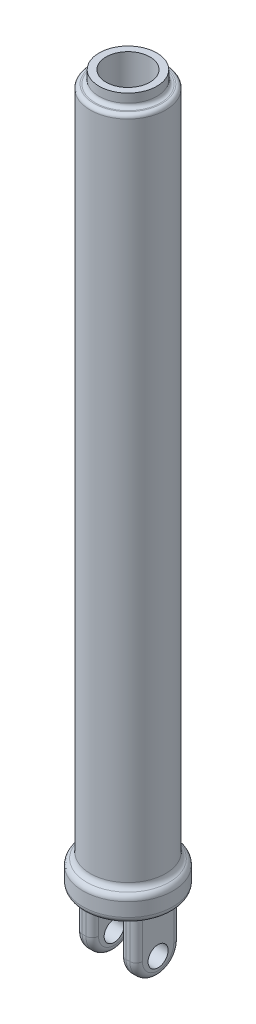
ISO-10303-21;
HEADER;
FILE_DESCRIPTION(('STEP AP214'),'2;1');
FILE_NAME('part.step','',(''),(''),'','','');
FILE_SCHEMA(('AUTOMOTIVE_DESIGN { 1 0 10303 214 1 1 1 1 }'));
ENDSEC;
DATA;
#1=APPLICATION_CONTEXT('core data for automotive mechanical design processes');
#2=APPLICATION_PROTOCOL_DEFINITION('international standard','automotive_design',2000,#1);
#3=PRODUCT_CONTEXT('',#1,'mechanical');
#4=PRODUCT('Part','Part','',(#3));
#5=PRODUCT_RELATED_PRODUCT_CATEGORY('part','',(#4));
#6=PRODUCT_DEFINITION_FORMATION('','',#4);
#7=PRODUCT_DEFINITION_CONTEXT('part definition',#1,'design');
#8=PRODUCT_DEFINITION('design','',#6,#7);
#9=PRODUCT_DEFINITION_SHAPE('','',#8);
#10=(LENGTH_UNIT() NAMED_UNIT(*) SI_UNIT(.MILLI.,.METRE.));
#11=(NAMED_UNIT(*) PLANE_ANGLE_UNIT() SI_UNIT($,.RADIAN.));
#12=(NAMED_UNIT(*) SI_UNIT($,.STERADIAN.) SOLID_ANGLE_UNIT());
#13=UNCERTAINTY_MEASURE_WITH_UNIT(LENGTH_MEASURE(1.E-05),#10,'distance_accuracy_value','');
#14=(GEOMETRIC_REPRESENTATION_CONTEXT(3) GLOBAL_UNCERTAINTY_ASSIGNED_CONTEXT((#13)) GLOBAL_UNIT_ASSIGNED_CONTEXT((#10,
#11,#12)) REPRESENTATION_CONTEXT('',''));
#15=CARTESIAN_POINT('',(0.,0.,0.));
#16=DIRECTION('',(0.,0.,1.));
#17=DIRECTION('',(1.,0.,0.));
#18=AXIS2_PLACEMENT_3D('',#15,#16,#17);
#19=CARTESIAN_POINT('',(23.9999999999998,-50.,17.4999999999999));
#20=DIRECTION('',(-0.999999999999994,0.,0.));
#21=DIRECTION('',(0.,0.,0.999999999999994));
#22=AXIS2_PLACEMENT_3D('',#19,#20,#21);
#23=PLANE('',#22);
#24=DIRECTION('',(0.,0.,0.999999999999994));
#25=VECTOR('',#24,1.);
#26=CARTESIAN_POINT('',(23.9999999999998,0.,17.4999999999999));
#27=LINE('',#26,#25);
#28=CARTESIAN_POINT('',(23.9999999999998,0.,-12.4999999999999));
#29=VERTEX_POINT('',#28);
#30=CARTESIAN_POINT('',(23.9999999999998,0.,12.4999999999999));
#31=VERTEX_POINT('',#30);
#32=EDGE_CURVE('E359',#29,#31,#27,.T.);
#33=ORIENTED_EDGE('',*,*,#32,.T.);
#34=DIRECTION('',(0.,1.,0.));
#35=VECTOR('',#34,1.);
#36=CARTESIAN_POINT('',(23.9999999999998,-50.,12.4999999999999));
#37=LINE('',#36,#35);
#38=CARTESIAN_POINT('',(23.9999999999998,-32.5,12.4999999999999));
#39=VERTEX_POINT('',#38);
#40=EDGE_CURVE('E428',#31,#39,#37,.F.);
#41=ORIENTED_EDGE('',*,*,#40,.T.);
#42=CARTESIAN_POINT('',(23.9999999999998,-32.5,0.));
#43=DIRECTION('',(-0.999999999999994,0.,0.));
#44=DIRECTION('',(0.,0.,0.999999999999994));
#45=AXIS2_PLACEMENT_3D('',#42,#43,#44);
#46=CIRCLE('',#45,12.5);
#47=CARTESIAN_POINT('',(23.9999999999998,-32.5,-12.4999999999999));
#48=VERTEX_POINT('',#47);
#49=EDGE_CURVE('E423',#39,#48,#46,.F.);
#50=ORIENTED_EDGE('',*,*,#49,.T.);
#51=DIRECTION('',(0.,1.,0.));
#52=VECTOR('',#51,1.);
#53=CARTESIAN_POINT('',(23.9999999999998,-50.,-12.4999999999999));
#54=LINE('',#53,#52);
#55=EDGE_CURVE('E425',#48,#29,#54,.T.);
#56=ORIENTED_EDGE('',*,*,#55,.T.);
#57=EDGE_LOOP('',(#33,#41,#50,#56));
#58=FACE_BOUND('',#57,.T.);
#59=CARTESIAN_POINT('',(23.9999999999998,-34.9999999999999,0.));
#60=DIRECTION('',(0.999999999999994,0.,0.));
#61=DIRECTION('',(0.,0.,-0.999999999999994));
#62=AXIS2_PLACEMENT_3D('',#59,#60,#61);
#63=CIRCLE('',#62,8.);
#64=CARTESIAN_POINT('',(23.9999999999998,-34.9999999999999,-7.99999999999997));
#65=VERTEX_POINT('',#64);
#66=EDGE_CURVE('E205',#65,#65,#63,.T.);
#67=ORIENTED_EDGE('',*,*,#66,.F.);
#68=EDGE_LOOP('',(#67));
#69=FACE_BOUND('',#68,.T.);
#70=ADVANCED_FACE('F64',(#58,#69),#23,.F.);
#71=CARTESIAN_POINT('',(10.9999999999999,-50.,17.4999999999999));
#72=DIRECTION('',(0.999999999999994,0.,0.));
#73=DIRECTION('',(0.,0.,-0.999999999999994));
#74=AXIS2_PLACEMENT_3D('',#71,#72,#73);
#75=PLANE('',#74);
#76=CARTESIAN_POINT('',(10.9999999999999,-34.9999999999999,0.));
#77=DIRECTION('',(0.999999999999994,0.,0.));
#78=DIRECTION('',(0.,0.,-0.999999999999994));
#79=AXIS2_PLACEMENT_3D('',#76,#77,#78);
#80=CIRCLE('',#79,8.);
#81=CARTESIAN_POINT('',(10.9999999999999,-34.9999999999999,-7.99999999999998));
#82=VERTEX_POINT('',#81);
#83=EDGE_CURVE('E337',#82,#82,#80,.T.);
#84=ORIENTED_EDGE('',*,*,#83,.T.);
#85=EDGE_LOOP('',(#84));
#86=FACE_BOUND('',#85,.T.);
#87=CARTESIAN_POINT('',(10.9999999999999,-32.5,0.));
#88=DIRECTION('',(0.999999999999994,0.,0.));
#89=DIRECTION('',(0.,0.,-0.999999999999994));
#90=AXIS2_PLACEMENT_3D('',#87,#88,#89);
#91=CIRCLE('',#90,12.5);
#92=CARTESIAN_POINT('',(10.9999999999999,-32.5,-12.4999999999999));
#93=VERTEX_POINT('',#92);
#94=CARTESIAN_POINT('',(10.9999999999999,-32.5,12.4999999999999));
#95=VERTEX_POINT('',#94);
#96=EDGE_CURVE('E437',#93,#95,#91,.F.);
#97=ORIENTED_EDGE('',*,*,#96,.T.);
#98=DIRECTION('',(0.,1.,0.));
#99=VECTOR('',#98,1.);
#100=CARTESIAN_POINT('',(10.9999999999999,-50.,12.4999999999999));
#101=LINE('',#100,#99);
#102=CARTESIAN_POINT('',(11.,0.,12.4999999999999));
#103=VERTEX_POINT('',#102);
#104=EDGE_CURVE('E221',#95,#103,#101,.T.);
#105=ORIENTED_EDGE('',*,*,#104,.T.);
#106=DIRECTION('',(0.,0.,-0.999999999999994));
#107=VECTOR('',#106,1.);
#108=CARTESIAN_POINT('',(10.9999999999999,0.,17.4999999999999));
#109=LINE('',#108,#107);
#110=CARTESIAN_POINT('',(10.9999999999999,0.,-12.4999999999999));
#111=VERTEX_POINT('',#110);
#112=EDGE_CURVE('E365',#103,#111,#109,.T.);
#113=ORIENTED_EDGE('',*,*,#112,.T.);
#114=DIRECTION('',(0.,1.,0.));
#115=VECTOR('',#114,1.);
#116=CARTESIAN_POINT('',(10.9999999999999,-50.,-12.4999999999999));
#117=LINE('',#116,#115);
#118=EDGE_CURVE('E440',#111,#93,#117,.F.);
#119=ORIENTED_EDGE('',*,*,#118,.T.);
#120=EDGE_LOOP('',(#97,#105,#113,#119));
#121=FACE_BOUND('',#120,.T.);
#122=ADVANCED_FACE('F488',(#86,#121),#75,.F.);
#123=CARTESIAN_POINT('',(-11.,-50.,17.4999999999999));
#124=DIRECTION('',(-0.999999999999994,0.,0.));
#125=DIRECTION('',(0.,0.,0.999999999999994));
#126=AXIS2_PLACEMENT_3D('',#123,#124,#125);
#127=PLANE('',#126);
#128=CARTESIAN_POINT('',(-11.,-34.9999999999999,0.));
#129=DIRECTION('',(-0.999999999999994,0.,0.));
#130=DIRECTION('',(0.,0.,0.999999999999994));
#131=AXIS2_PLACEMENT_3D('',#128,#129,#130);
#132=CIRCLE('',#131,8.);
#133=CARTESIAN_POINT('',(-11.,-34.9999999999999,7.99999999999991));
#134=VERTEX_POINT('',#133);
#135=EDGE_CURVE('E334',#134,#134,#132,.T.);
#136=ORIENTED_EDGE('',*,*,#135,.T.);
#137=EDGE_LOOP('',(#136));
#138=FACE_BOUND('',#137,.T.);
#139=CARTESIAN_POINT('',(-11.,-32.5,0.));
#140=DIRECTION('',(-0.999999999999994,0.,0.));
#141=DIRECTION('',(0.,0.,0.999999999999994));
#142=AXIS2_PLACEMENT_3D('',#139,#140,#141);
#143=CIRCLE('',#142,12.5);
#144=CARTESIAN_POINT('',(-11.,-32.5,12.4999999999998));
#145=VERTEX_POINT('',#144);
#146=CARTESIAN_POINT('',(-11.,-32.5,-12.5));
#147=VERTEX_POINT('',#146);
#148=EDGE_CURVE('E445',#145,#147,#143,.F.);
#149=ORIENTED_EDGE('',*,*,#148,.T.);
#150=DIRECTION('',(0.,1.,0.));
#151=VECTOR('',#150,1.);
#152=CARTESIAN_POINT('',(-11.,-50.,-12.4999999999999));
#153=LINE('',#152,#151);
#154=CARTESIAN_POINT('',(-11.,0.,-12.4999999999999));
#155=VERTEX_POINT('',#154);
#156=EDGE_CURVE('E265',#147,#155,#153,.T.);
#157=ORIENTED_EDGE('',*,*,#156,.T.);
#158=DIRECTION('',(0.,0.,0.999999999999994));
#159=VECTOR('',#158,1.);
#160=CARTESIAN_POINT('',(-11.,0.,17.4999999999999));
#161=LINE('',#160,#159);
#162=CARTESIAN_POINT('',(-10.9999999999999,0.,12.4999999999999));
#163=VERTEX_POINT('',#162);
#164=EDGE_CURVE('E346',#155,#163,#161,.T.);
#165=ORIENTED_EDGE('',*,*,#164,.T.);
#166=DIRECTION('',(0.,1.,0.));
#167=VECTOR('',#166,1.);
#168=CARTESIAN_POINT('',(-11.,-50.,12.4999999999999));
#169=LINE('',#168,#167);
#170=EDGE_CURVE('E273',#163,#145,#169,.F.);
#171=ORIENTED_EDGE('',*,*,#170,.T.);
#172=EDGE_LOOP('',(#149,#157,#165,#171));
#173=FACE_BOUND('',#172,.T.);
#174=ADVANCED_FACE('F450',(#138,#173),#127,.F.);
#175=CARTESIAN_POINT('',(-23.9999999999998,-50.,17.4999999999998));
#176=DIRECTION('',(0.999999999999994,0.,0.));
#177=DIRECTION('',(0.,0.,-0.999999999999994));
#178=AXIS2_PLACEMENT_3D('',#175,#176,#177);
#179=PLANE('',#178);
#180=CARTESIAN_POINT('',(-23.9999999999998,-34.9999999999999,0.));
#181=DIRECTION('',(0.999999999999994,0.,0.));
#182=DIRECTION('',(0.,0.,-0.999999999999994));
#183=AXIS2_PLACEMENT_3D('',#180,#181,#182);
#184=CIRCLE('',#183,8.);
#185=CARTESIAN_POINT('',(-23.9999999999998,-34.9999999999999,-7.99999999999999));
#186=VERTEX_POINT('',#185);
#187=EDGE_CURVE('E333',#186,#186,#184,.T.);
#188=ORIENTED_EDGE('',*,*,#187,.T.);
#189=EDGE_LOOP('',(#188));
#190=FACE_BOUND('',#189,.T.);
#191=CARTESIAN_POINT('',(-23.9999999999998,-32.5,0.));
#192=DIRECTION('',(0.999999999999994,0.,0.));
#193=DIRECTION('',(0.,0.,-0.999999999999994));
#194=AXIS2_PLACEMENT_3D('',#191,#192,#193);
#195=CIRCLE('',#194,12.5);
#196=CARTESIAN_POINT('',(-23.9999999999998,-32.5,-12.4999999999999));
#197=VERTEX_POINT('',#196);
#198=CARTESIAN_POINT('',(-23.9999999999998,-32.5,12.4999999999999));
#199=VERTEX_POINT('',#198);
#200=EDGE_CURVE('E82',#197,#199,#195,.F.);
#201=ORIENTED_EDGE('',*,*,#200,.T.);
#202=DIRECTION('',(0.,1.,0.));
#203=VECTOR('',#202,1.);
#204=CARTESIAN_POINT('',(-23.9999999999998,-50.,12.4999999999999));
#205=LINE('',#204,#203);
#206=CARTESIAN_POINT('',(-23.9999999999998,0.,12.4999999999999));
#207=VERTEX_POINT('',#206);
#208=EDGE_CURVE('E217',#199,#207,#205,.T.);
#209=ORIENTED_EDGE('',*,*,#208,.T.);
#210=DIRECTION('',(0.,0.,-0.999999999999994));
#211=VECTOR('',#210,1.);
#212=CARTESIAN_POINT('',(-23.9999999999998,0.,17.4999999999999));
#213=LINE('',#212,#211);
#214=CARTESIAN_POINT('',(-23.9999999999998,0.,-12.4999999999999));
#215=VERTEX_POINT('',#214);
#216=EDGE_CURVE('E354',#207,#215,#213,.T.);
#217=ORIENTED_EDGE('',*,*,#216,.T.);
#218=DIRECTION('',(0.,1.,0.));
#219=VECTOR('',#218,1.);
#220=CARTESIAN_POINT('',(-23.9999999999998,-50.,-12.4999999999999));
#221=LINE('',#220,#219);
#222=EDGE_CURVE('E87',#215,#197,#221,.F.);
#223=ORIENTED_EDGE('',*,*,#222,.T.);
#224=EDGE_LOOP('',(#201,#209,#217,#223));
#225=FACE_BOUND('',#224,.T.);
#226=ADVANCED_FACE('F473',(#190,#225),#179,.F.);
#227=CARTESIAN_POINT('',(10.9999999999999,-50.,-17.4999999999999));
#228=DIRECTION('',(0.,0.,0.999999999999994));
#229=DIRECTION('',(0.999999999999994,0.,0.));
#230=AXIS2_PLACEMENT_3D('',#227,#228,#229);
#231=PLANE('',#230);
#232=DIRECTION('',(0.999999999999994,0.,0.));
#233=VECTOR('',#232,1.);
#234=CARTESIAN_POINT('',(11.,0.,-17.4999999999999));
#235=LINE('',#234,#233);
#236=CARTESIAN_POINT('',(15.9999999999999,0.,-17.4999999999999));
#237=VERTEX_POINT('',#236);
#238=CARTESIAN_POINT('',(18.9999999999999,0.,-17.4999999999999));
#239=VERTEX_POINT('',#238);
#240=EDGE_CURVE('E369',#237,#239,#235,.T.);
#241=ORIENTED_EDGE('',*,*,#240,.T.);
#242=DIRECTION('',(0.,1.,0.));
#243=VECTOR('',#242,1.);
#244=CARTESIAN_POINT('',(18.9999999999999,-50.,-17.4999999999999));
#245=LINE('',#244,#243);
#246=CARTESIAN_POINT('',(18.9999999999999,-32.5,-17.4999999999999));
#247=VERTEX_POINT('',#246);
#248=EDGE_CURVE('E434',#239,#247,#245,.F.);
#249=ORIENTED_EDGE('',*,*,#248,.T.);
#250=DIRECTION('',(0.999999999999994,0.,0.));
#251=VECTOR('',#250,1.);
#252=CARTESIAN_POINT('',(-35.8238545691087,-32.5,-17.4999999999999));
#253=LINE('',#252,#251);
#254=CARTESIAN_POINT('',(15.9999999999999,-32.5,-17.4999999999999));
#255=VERTEX_POINT('',#254);
#256=EDGE_CURVE('E341',#255,#247,#253,.T.);
#257=ORIENTED_EDGE('',*,*,#256,.F.);
#258=DIRECTION('',(0.,1.,0.));
#259=VECTOR('',#258,1.);
#260=CARTESIAN_POINT('',(15.9999999999999,-50.,-17.4999999999999));
#261=LINE('',#260,#259);
#262=EDGE_CURVE('E431',#255,#237,#261,.T.);
#263=ORIENTED_EDGE('',*,*,#262,.T.);
#264=EDGE_LOOP('',(#241,#249,#257,#263));
#265=FACE_BOUND('',#264,.T.);
#266=ADVANCED_FACE('F720',(#265),#231,.F.);
#267=CARTESIAN_POINT('',(-11.,-50.,-17.4999999999999));
#268=DIRECTION('',(0.,0.,0.999999999999994));
#269=DIRECTION('',(0.999999999999994,0.,0.));
#270=AXIS2_PLACEMENT_3D('',#267,#268,#269);
#271=PLANE('',#270);
#272=DIRECTION('',(0.999999999999994,0.,0.));
#273=VECTOR('',#272,1.);
#274=CARTESIAN_POINT('',(-11.,0.,-17.4999999999999));
#275=LINE('',#274,#273);
#276=CARTESIAN_POINT('',(-18.9999999999999,0.,-17.4999999999999));
#277=VERTEX_POINT('',#276);
#278=CARTESIAN_POINT('',(-15.9999999999999,0.,-17.4999999999999));
#279=VERTEX_POINT('',#278);
#280=EDGE_CURVE('E356',#277,#279,#275,.T.);
#281=ORIENTED_EDGE('',*,*,#280,.T.);
#282=DIRECTION('',(0.,1.,0.));
#283=VECTOR('',#282,1.);
#284=CARTESIAN_POINT('',(-15.9999999999999,-50.,-17.4999999999999));
#285=LINE('',#284,#283);
#286=CARTESIAN_POINT('',(-15.9999999999999,-32.5,-17.4999999999999));
#287=VERTEX_POINT('',#286);
#288=EDGE_CURVE('E264',#279,#287,#285,.F.);
#289=ORIENTED_EDGE('',*,*,#288,.T.);
#290=CARTESIAN_POINT('',(-18.9999999999999,-32.5,-17.4999999999999));
#291=VERTEX_POINT('',#290);
#292=EDGE_CURVE('E342',#291,#287,#253,.T.);
#293=ORIENTED_EDGE('',*,*,#292,.F.);
#294=DIRECTION('',(0.,1.,0.));
#295=VECTOR('',#294,1.);
#296=CARTESIAN_POINT('',(-18.9999999999999,-50.,-17.4999999999999));
#297=LINE('',#296,#295);
#298=EDGE_CURVE('E258',#291,#277,#297,.T.);
#299=ORIENTED_EDGE('',*,*,#298,.T.);
#300=EDGE_LOOP('',(#281,#289,#293,#299));
#301=FACE_BOUND('',#300,.T.);
#302=ADVANCED_FACE('F474',(#301),#271,.F.);
#303=CARTESIAN_POINT('',(0.,0.,0.));
#304=DIRECTION('',(0.,-1.,0.));
#305=DIRECTION('',(0.,0.,-0.999999999999994));
#306=AXIS2_PLACEMENT_3D('',#303,#304,#305);
#307=PLANE('',#306);
#308=CARTESIAN_POINT('',(0.,0.,0.));
#309=DIRECTION('',(0.,1.,0.));
#310=DIRECTION('',(0.,0.,0.999999999999994));
#311=AXIS2_PLACEMENT_3D('',#308,#309,#310);
#312=CIRCLE('',#311,30.8238545691088);
#313=CARTESIAN_POINT('',(0.,0.,30.8238545691086));
#314=VERTEX_POINT('',#313);
#315=EDGE_CURVE('E193',#314,#314,#312,.T.);
#316=ORIENTED_EDGE('',*,*,#315,.F.);
#317=EDGE_LOOP('',(#316));
#318=FACE_BOUND('',#317,.T.);
#319=DIRECTION('',(-0.999999999999994,0.,0.));
#320=VECTOR('',#319,1.);
#321=CARTESIAN_POINT('',(10.9999999999999,0.,17.4999999999999));
#322=LINE('',#321,#320);
#323=CARTESIAN_POINT('',(18.9999999999999,0.,17.4999999999999));
#324=VERTEX_POINT('',#323);
#325=CARTESIAN_POINT('',(15.9999999999999,0.,17.4999999999999));
#326=VERTEX_POINT('',#325);
#327=EDGE_CURVE('E188',#324,#326,#322,.T.);
#328=ORIENTED_EDGE('',*,*,#327,.F.);
#329=CARTESIAN_POINT('',(18.9999999999999,0.,12.4999999999999));
#330=DIRECTION('',(0.,-1.,0.));
#331=DIRECTION('',(0.,0.,-0.999999999999994));
#332=AXIS2_PLACEMENT_3D('',#329,#330,#331);
#333=CIRCLE('',#332,5.);
#334=EDGE_CURVE('E294',#324,#31,#333,.F.);
#335=ORIENTED_EDGE('',*,*,#334,.T.);
#336=ORIENTED_EDGE('',*,*,#32,.F.);
#337=CARTESIAN_POINT('',(18.9999999999999,0.,-12.4999999999999));
#338=DIRECTION('',(0.,-1.,0.));
#339=DIRECTION('',(0.,0.,-0.999999999999994));
#340=AXIS2_PLACEMENT_3D('',#337,#338,#339);
#341=CIRCLE('',#340,5.);
#342=EDGE_CURVE('E297',#29,#239,#341,.F.);
#343=ORIENTED_EDGE('',*,*,#342,.T.);
#344=ORIENTED_EDGE('',*,*,#240,.F.);
#345=CARTESIAN_POINT('',(15.9999999999999,0.,-12.4999999999999));
#346=DIRECTION('',(0.,-1.,0.));
#347=DIRECTION('',(0.,0.,-0.999999999999994));
#348=AXIS2_PLACEMENT_3D('',#345,#346,#347);
#349=CIRCLE('',#348,5.);
#350=EDGE_CURVE('E302',#237,#111,#349,.F.);
#351=ORIENTED_EDGE('',*,*,#350,.T.);
#352=ORIENTED_EDGE('',*,*,#112,.F.);
#353=CARTESIAN_POINT('',(15.9999999999999,0.,12.4999999999999));
#354=DIRECTION('',(0.,-1.,0.));
#355=DIRECTION('',(0.,0.,-0.999999999999994));
#356=AXIS2_PLACEMENT_3D('',#353,#354,#355);
#357=CIRCLE('',#356,5.);
#358=EDGE_CURVE('E299',#103,#326,#357,.F.);
#359=ORIENTED_EDGE('',*,*,#358,.T.);
#360=EDGE_LOOP('',(#328,#335,#336,#343,#344,#351,#352,#359));
#361=FACE_BOUND('',#360,.T.);
#362=DIRECTION('',(-0.999999999999994,0.,0.));
#363=VECTOR('',#362,1.);
#364=CARTESIAN_POINT('',(-11.,0.,17.4999999999999));
#365=LINE('',#364,#363);
#366=CARTESIAN_POINT('',(-15.9999999999999,0.,17.4999999999999));
#367=VERTEX_POINT('',#366);
#368=CARTESIAN_POINT('',(-18.9999999999999,0.,17.4999999999999));
#369=VERTEX_POINT('',#368);
#370=EDGE_CURVE('E350',#367,#369,#365,.T.);
#371=ORIENTED_EDGE('',*,*,#370,.F.);
#372=CARTESIAN_POINT('',(-15.9999999999999,0.,12.4999999999999));
#373=DIRECTION('',(0.,-1.,0.));
#374=DIRECTION('',(0.,0.,-0.999999999999994));
#375=AXIS2_PLACEMENT_3D('',#372,#373,#374);
#376=CIRCLE('',#375,5.);
#377=EDGE_CURVE('E308',#367,#163,#376,.F.);
#378=ORIENTED_EDGE('',*,*,#377,.T.);
#379=ORIENTED_EDGE('',*,*,#164,.F.);
#380=CARTESIAN_POINT('',(-15.9999999999999,0.,-12.4999999999999));
#381=DIRECTION('',(0.,-1.,0.));
#382=DIRECTION('',(0.,0.,-0.999999999999994));
#383=AXIS2_PLACEMENT_3D('',#380,#381,#382);
#384=CIRCLE('',#383,5.);
#385=EDGE_CURVE('E305',#155,#279,#384,.F.);
#386=ORIENTED_EDGE('',*,*,#385,.T.);
#387=ORIENTED_EDGE('',*,*,#280,.F.);
#388=CARTESIAN_POINT('',(-18.9999999999999,0.,-12.4999999999999));
#389=DIRECTION('',(0.,-1.,0.));
#390=DIRECTION('',(0.,0.,-0.999999999999994));
#391=AXIS2_PLACEMENT_3D('',#388,#389,#390);
#392=CIRCLE('',#391,5.);
#393=EDGE_CURVE('E12',#277,#215,#392,.F.);
#394=ORIENTED_EDGE('',*,*,#393,.T.);
#395=ORIENTED_EDGE('',*,*,#216,.F.);
#396=CARTESIAN_POINT('',(-18.9999999999999,0.,12.4999999999999));
#397=DIRECTION('',(0.,-1.,0.));
#398=DIRECTION('',(0.,0.,-0.999999999999994));
#399=AXIS2_PLACEMENT_3D('',#396,#397,#398);
#400=CIRCLE('',#399,5.);
#401=EDGE_CURVE('E74',#207,#369,#400,.F.);
#402=ORIENTED_EDGE('',*,*,#401,.T.);
#403=EDGE_LOOP('',(#371,#378,#379,#386,#387,#394,#395,#402));
#404=FACE_BOUND('',#403,.T.);
#405=ADVANCED_FACE('F467',(#318,#361,#404),#307,.T.);
#406=CARTESIAN_POINT('',(0.,4.99999999999989,0.));
#407=DIRECTION('',(0.,1.,0.));
#408=DIRECTION('',(0.,0.,0.999999999999994));
#409=AXIS2_PLACEMENT_3D('',#406,#407,#408);
#410=TOROIDAL_SURFACE('',#409,30.8238545691088,5.);
#411=ORIENTED_EDGE('',*,*,#315,.T.);
#412=EDGE_LOOP('',(#411));
#413=FACE_BOUND('',#412,.T.);
#414=CARTESIAN_POINT('',(0.,4.99999999999989,0.));
#415=DIRECTION('',(0.,1.,0.));
#416=DIRECTION('',(0.,0.,0.999999999999994));
#417=AXIS2_PLACEMENT_3D('',#414,#415,#416);
#418=CIRCLE('',#417,35.8238545691088);
#419=CARTESIAN_POINT('',(0.,4.99999999999989,35.8238545691086));
#420=VERTEX_POINT('',#419);
#421=EDGE_CURVE('E412',#420,#420,#418,.T.);
#422=ORIENTED_EDGE('',*,*,#421,.F.);
#423=EDGE_LOOP('',(#422));
#424=FACE_BOUND('',#423,.T.);
#425=ADVANCED_FACE('F542',(#413,#424),#410,.T.);
#426=CARTESIAN_POINT('',(0.,40.,0.));
#427=DIRECTION('',(0.,1.,0.));
#428=DIRECTION('',(0.,0.,0.999999999999994));
#429=AXIS2_PLACEMENT_3D('',#426,#427,#428);
#430=CYLINDRICAL_SURFACE('',#429,35.8238545691088);
#431=ORIENTED_EDGE('',*,*,#421,.T.);
#432=EDGE_LOOP('',(#431));
#433=FACE_BOUND('',#432,.T.);
#434=CARTESIAN_POINT('',(0.,15.891115505243,0.));
#435=DIRECTION('',(0.,1.,0.));
#436=DIRECTION('',(0.,0.,0.999999999999994));
#437=AXIS2_PLACEMENT_3D('',#434,#435,#436);
#438=CIRCLE('',#437,35.8238545691088);
#439=CARTESIAN_POINT('',(0.,15.891115505243,35.8238545691086));
#440=VERTEX_POINT('',#439);
#441=EDGE_CURVE('E408',#440,#440,#438,.T.);
#442=ORIENTED_EDGE('',*,*,#441,.F.);
#443=EDGE_LOOP('',(#442));
#444=FACE_BOUND('',#443,.T.);
#445=ADVANCED_FACE('F538',(#433,#444),#430,.T.);
#446=CARTESIAN_POINT('',(0.,15.891115505243,0.));
#447=DIRECTION('',(0.,1.,0.));
#448=DIRECTION('',(0.,0.,0.999999999999994));
#449=AXIS2_PLACEMENT_3D('',#446,#447,#448);
#450=TOROIDAL_SURFACE('',#449,30.8238545691088,5.);
#451=ORIENTED_EDGE('',*,*,#441,.T.);
#452=EDGE_LOOP('',(#451));
#453=FACE_BOUND('',#452,.T.);
#454=CARTESIAN_POINT('',(0.,20.4342369360451,0.));
#455=DIRECTION('',(0.,1.,0.));
#456=DIRECTION('',(0.,0.,0.999999999999994));
#457=AXIS2_PLACEMENT_3D('',#454,#455,#456);
#458=CIRCLE('',#457,32.9119272845545);
#459=CARTESIAN_POINT('',(0.,20.4342369360451,32.9119272845543));
#460=VERTEX_POINT('',#459);
#461=EDGE_CURVE('E404',#460,#460,#458,.T.);
#462=ORIENTED_EDGE('',*,*,#461,.F.);
#463=EDGE_LOOP('',(#462));
#464=FACE_BOUND('',#463,.T.);
#465=ADVANCED_FACE('F534',(#453,#464),#450,.T.);
#466=CARTESIAN_POINT('',(0.,24.9773583668469,0.));
#467=DIRECTION('',(0.,1.,0.));
#468=DIRECTION('',(0.,0.,0.999999999999994));
#469=AXIS2_PLACEMENT_3D('',#466,#467,#468);
#470=TOROIDAL_SURFACE('',#469,35.0000000000001,4.99999999999999);
#471=ORIENTED_EDGE('',*,*,#461,.T.);
#472=EDGE_LOOP('',(#471));
#473=FACE_BOUND('',#472,.T.);
#474=CARTESIAN_POINT('',(0.,24.9773583668469,0.));
#475=DIRECTION('',(0.,1.,0.));
#476=DIRECTION('',(0.,0.,0.999999999999994));
#477=AXIS2_PLACEMENT_3D('',#474,#475,#476);
#478=CIRCLE('',#477,30.0000000000001);
#479=CARTESIAN_POINT('',(0.,24.9773583668469,29.9999999999999));
#480=VERTEX_POINT('',#479);
#481=EDGE_CURVE('E400',#480,#480,#478,.T.);
#482=ORIENTED_EDGE('',*,*,#481,.F.);
#483=EDGE_LOOP('',(#482));
#484=FACE_BOUND('',#483,.T.);
#485=ADVANCED_FACE('F530',(#473,#484),#470,.F.);
#486=CARTESIAN_POINT('',(0.,40.,0.));
#487=DIRECTION('',(0.,1.,0.));
#488=DIRECTION('',(0.,0.,0.999999999999994));
#489=AXIS2_PLACEMENT_3D('',#486,#487,#488);
#490=CYLINDRICAL_SURFACE('',#489,30.);
#491=ORIENTED_EDGE('',*,*,#481,.T.);
#492=EDGE_LOOP('',(#491));
#493=FACE_BOUND('',#492,.T.);
#494=CARTESIAN_POINT('',(0.,552.,0.));
#495=DIRECTION('',(0.,1.,0.));
#496=DIRECTION('',(0.,0.,0.999999999999994));
#497=AXIS2_PLACEMENT_3D('',#494,#495,#496);
#498=CIRCLE('',#497,30.);
#499=CARTESIAN_POINT('',(0.,552.,29.9999999999998));
#500=VERTEX_POINT('',#499);
#501=EDGE_CURVE('E396',#500,#500,#498,.T.);
#502=ORIENTED_EDGE('',*,*,#501,.F.);
#503=EDGE_LOOP('',(#502));
#504=FACE_BOUND('',#503,.T.);
#505=ADVANCED_FACE('F526',(#493,#504),#490,.T.);
#506=CARTESIAN_POINT('',(0.,552.,0.));
#507=DIRECTION('',(0.,1.,0.));
#508=DIRECTION('',(0.,0.,0.999999999999994));
#509=AXIS2_PLACEMENT_3D('',#506,#507,#508);
#510=TOROIDAL_SURFACE('',#509,27.,3.);
#511=ORIENTED_EDGE('',*,*,#501,.T.);
#512=EDGE_LOOP('',(#511));
#513=FACE_BOUND('',#512,.T.);
#514=CARTESIAN_POINT('',(0.,555.,0.));
#515=DIRECTION('',(0.,1.,0.));
#516=DIRECTION('',(0.,0.,0.999999999999994));
#517=AXIS2_PLACEMENT_3D('',#514,#515,#516);
#518=CIRCLE('',#517,27.);
#519=CARTESIAN_POINT('',(0.,555.,26.9999999999998));
#520=VERTEX_POINT('',#519);
#521=EDGE_CURVE('E392',#520,#520,#518,.T.);
#522=ORIENTED_EDGE('',*,*,#521,.F.);
#523=EDGE_LOOP('',(#522));
#524=FACE_BOUND('',#523,.T.);
#525=ADVANCED_FACE('F522',(#513,#524),#510,.T.);
#526=CARTESIAN_POINT('',(-26.9999999999998,555.,0.));
#527=DIRECTION('',(0.,1.,0.));
#528=DIRECTION('',(0.,0.,0.999999999999994));
#529=AXIS2_PLACEMENT_3D('',#526,#527,#528);
#530=PLANE('',#529);
#531=ORIENTED_EDGE('',*,*,#521,.T.);
#532=EDGE_LOOP('',(#531));
#533=FACE_BOUND('',#532,.T.);
#534=CARTESIAN_POINT('',(0.,555.,0.));
#535=DIRECTION('',(0.,1.,0.));
#536=DIRECTION('',(0.,0.,0.999999999999994));
#537=AXIS2_PLACEMENT_3D('',#534,#535,#536);
#538=CIRCLE('',#537,26.);
#539=CARTESIAN_POINT('',(0.,555.,25.9999999999998));
#540=VERTEX_POINT('',#539);
#541=EDGE_CURVE('E388',#540,#540,#538,.T.);
#542=ORIENTED_EDGE('',*,*,#541,.F.);
#543=EDGE_LOOP('',(#542));
#544=FACE_BOUND('',#543,.T.);
#545=ADVANCED_FACE('F518',(#533,#544),#530,.T.);
#546=CARTESIAN_POINT('',(0.,558.,0.));
#547=DIRECTION('',(0.,1.,0.));
#548=DIRECTION('',(0.,0.,0.999999999999994));
#549=AXIS2_PLACEMENT_3D('',#546,#547,#548);
#550=TOROIDAL_SURFACE('',#549,26.,3.00000000000011);
#551=ORIENTED_EDGE('',*,*,#541,.T.);
#552=EDGE_LOOP('',(#551));
#553=FACE_BOUND('',#552,.T.);
#554=CARTESIAN_POINT('',(0.,558.,0.));
#555=DIRECTION('',(0.,1.,0.));
#556=DIRECTION('',(0.,0.,0.999999999999994));
#557=AXIS2_PLACEMENT_3D('',#554,#555,#556);
#558=CIRCLE('',#557,22.9999999999999);
#559=CARTESIAN_POINT('',(0.,558.,22.9999999999997));
#560=VERTEX_POINT('',#559);
#561=EDGE_CURVE('E384',#560,#560,#558,.T.);
#562=ORIENTED_EDGE('',*,*,#561,.F.);
#563=EDGE_LOOP('',(#562));
#564=FACE_BOUND('',#563,.T.);
#565=ADVANCED_FACE('F514',(#553,#564),#550,.F.);
#566=CARTESIAN_POINT('',(0.,40.,0.));
#567=DIRECTION('',(0.,1.,0.));
#568=DIRECTION('',(0.,0.,0.999999999999994));
#569=AXIS2_PLACEMENT_3D('',#566,#567,#568);
#570=CYLINDRICAL_SURFACE('',#569,22.9999999999999);
#571=ORIENTED_EDGE('',*,*,#561,.T.);
#572=EDGE_LOOP('',(#571));
#573=FACE_BOUND('',#572,.T.);
#574=CARTESIAN_POINT('',(0.,565.,0.));
#575=DIRECTION('',(0.,1.,0.));
#576=DIRECTION('',(0.,0.,0.999999999999994));
#577=AXIS2_PLACEMENT_3D('',#574,#575,#576);
#578=CIRCLE('',#577,23.);
#579=CARTESIAN_POINT('',(0.,565.,22.9999999999999));
#580=VERTEX_POINT('',#579);
#581=EDGE_CURVE('E380',#580,#580,#578,.T.);
#582=ORIENTED_EDGE('',*,*,#581,.F.);
#583=EDGE_LOOP('',(#582));
#584=FACE_BOUND('',#583,.T.);
#585=ADVANCED_FACE('F510',(#573,#584),#570,.T.);
#586=CARTESIAN_POINT('',(-17.4999999999999,565.,0.));
#587=DIRECTION('',(0.,1.,0.));
#588=DIRECTION('',(0.,0.,0.999999999999994));
#589=AXIS2_PLACEMENT_3D('',#586,#587,#588);
#590=PLANE('',#589);
#591=ORIENTED_EDGE('',*,*,#581,.T.);
#592=EDGE_LOOP('',(#591));
#593=FACE_BOUND('',#592,.T.);
#594=CARTESIAN_POINT('',(0.,565.,0.));
#595=DIRECTION('',(0.,1.,0.));
#596=DIRECTION('',(0.,0.,0.999999999999994));
#597=AXIS2_PLACEMENT_3D('',#594,#595,#596);
#598=CIRCLE('',#597,17.5);
#599=CARTESIAN_POINT('',(0.,565.,17.4999999999999));
#600=VERTEX_POINT('',#599);
#601=EDGE_CURVE('E376',#600,#600,#598,.T.);
#602=ORIENTED_EDGE('',*,*,#601,.F.);
#603=EDGE_LOOP('',(#602));
#604=FACE_BOUND('',#603,.T.);
#605=ADVANCED_FACE('F506',(#593,#604),#590,.T.);
#606=CARTESIAN_POINT('',(0.,40.,0.));
#607=DIRECTION('',(0.,1.,0.));
#608=DIRECTION('',(0.,0.,0.999999999999994));
#609=AXIS2_PLACEMENT_3D('',#606,#607,#608);
#610=CYLINDRICAL_SURFACE('',#609,17.5);
#611=ORIENTED_EDGE('',*,*,#601,.T.);
#612=EDGE_LOOP('',(#611));
#613=FACE_BOUND('',#612,.T.);
#614=CARTESIAN_POINT('',(0.,40.,0.));
#615=DIRECTION('',(0.,1.,0.));
#616=DIRECTION('',(0.,0.,0.999999999999994));
#617=AXIS2_PLACEMENT_3D('',#614,#615,#616);
#618=CIRCLE('',#617,17.4999999999999);
#619=CARTESIAN_POINT('',(0.,40.,17.4999999999998));
#620=VERTEX_POINT('',#619);
#621=EDGE_CURVE('E372',#620,#620,#618,.T.);
#622=ORIENTED_EDGE('',*,*,#621,.F.);
#623=EDGE_LOOP('',(#622));
#624=FACE_BOUND('',#623,.T.);
#625=ADVANCED_FACE('F502',(#613,#624),#610,.F.);
#626=CARTESIAN_POINT('',(-17.4999999999998,40.,0.));
#627=DIRECTION('',(0.,1.,0.));
#628=DIRECTION('',(0.,0.,0.999999999999994));
#629=AXIS2_PLACEMENT_3D('',#626,#627,#628);
#630=PLANE('',#629);
#631=ORIENTED_EDGE('',*,*,#621,.T.);
#632=EDGE_LOOP('',(#631));
#633=FACE_BOUND('',#632,.T.);
#634=ADVANCED_FACE('F499',(#633),#630,.T.);
#635=CARTESIAN_POINT('',(10.9999999999999,-50.,17.4999999999999));
#636=DIRECTION('',(0.,0.,-0.999999999999994));
#637=DIRECTION('',(-0.999999999999994,0.,0.));
#638=AXIS2_PLACEMENT_3D('',#635,#636,#637);
#639=PLANE('',#638);
#640=DIRECTION('',(0.999999999999994,0.,0.));
#641=VECTOR('',#640,1.);
#642=CARTESIAN_POINT('',(-35.8238545691087,-32.5,17.4999999999999));
#643=LINE('',#642,#641);
#644=CARTESIAN_POINT('',(15.9999999999999,-32.5,17.4999999999999));
#645=VERTEX_POINT('',#644);
#646=CARTESIAN_POINT('',(18.9999999999999,-32.5,17.4999999999999));
#647=VERTEX_POINT('',#646);
#648=EDGE_CURVE('E185',#645,#647,#643,.T.);
#649=ORIENTED_EDGE('',*,*,#648,.T.);
#650=DIRECTION('',(0.,1.,0.));
#651=VECTOR('',#650,1.);
#652=CARTESIAN_POINT('',(18.9999999999999,-50.,17.4999999999999));
#653=LINE('',#652,#651);
#654=EDGE_CURVE('E192',#647,#324,#653,.T.);
#655=ORIENTED_EDGE('',*,*,#654,.T.);
#656=ORIENTED_EDGE('',*,*,#327,.T.);
#657=DIRECTION('',(0.,1.,0.));
#658=VECTOR('',#657,1.);
#659=CARTESIAN_POINT('',(15.9999999999999,-50.,17.4999999999999));
#660=LINE('',#659,#658);
#661=EDGE_CURVE('E181',#326,#645,#660,.F.);
#662=ORIENTED_EDGE('',*,*,#661,.T.);
#663=EDGE_LOOP('',(#649,#655,#656,#662));
#664=FACE_BOUND('',#663,.T.);
#665=ADVANCED_FACE('F183',(#664),#639,.F.);
#666=CARTESIAN_POINT('',(-11.,-50.,17.4999999999999));
#667=DIRECTION('',(0.,0.,-0.999999999999994));
#668=DIRECTION('',(-0.999999999999994,0.,0.));
#669=AXIS2_PLACEMENT_3D('',#666,#667,#668);
#670=PLANE('',#669);
#671=CARTESIAN_POINT('',(-18.9999999999999,-32.5,17.4999999999999));
#672=VERTEX_POINT('',#671);
#673=CARTESIAN_POINT('',(-15.9999999999999,-32.5,17.4999999999999));
#674=VERTEX_POINT('',#673);
#675=EDGE_CURVE('E204',#672,#674,#643,.T.);
#676=ORIENTED_EDGE('',*,*,#675,.T.);
#677=DIRECTION('',(0.,1.,0.));
#678=VECTOR('',#677,1.);
#679=CARTESIAN_POINT('',(-15.9999999999999,-50.,17.4999999999999));
#680=LINE('',#679,#678);
#681=EDGE_CURVE('E279',#674,#367,#680,.T.);
#682=ORIENTED_EDGE('',*,*,#681,.T.);
#683=ORIENTED_EDGE('',*,*,#370,.T.);
#684=DIRECTION('',(0.,1.,0.));
#685=VECTOR('',#684,1.);
#686=CARTESIAN_POINT('',(-18.9999999999999,-50.,17.4999999999999));
#687=LINE('',#686,#685);
#688=EDGE_CURVE('E269',#369,#672,#687,.F.);
#689=ORIENTED_EDGE('',*,*,#688,.T.);
#690=EDGE_LOOP('',(#676,#682,#683,#689));
#691=FACE_BOUND('',#690,.T.);
#692=ADVANCED_FACE('F470',(#691),#670,.F.);
#693=CARTESIAN_POINT('',(-35.8238545691087,-32.5,0.));
#694=DIRECTION('',(0.999999999999994,0.,0.));
#695=DIRECTION('',(0.,0.,-0.999999999999994));
#696=AXIS2_PLACEMENT_3D('',#693,#694,#695);
#697=CYLINDRICAL_SURFACE('',#696,17.5);
#698=ORIENTED_EDGE('',*,*,#292,.T.);
#699=CARTESIAN_POINT('',(-15.9999999999999,-32.5,0.));
#700=DIRECTION('',(-0.999999999999994,0.,0.));
#701=DIRECTION('',(0.,0.,0.999999999999994));
#702=AXIS2_PLACEMENT_3D('',#699,#700,#701);
#703=CIRCLE('',#702,17.5);
#704=EDGE_CURVE('E291',#287,#674,#703,.T.);
#705=ORIENTED_EDGE('',*,*,#704,.T.);
#706=ORIENTED_EDGE('',*,*,#675,.F.);
#707=CARTESIAN_POINT('',(-18.9999999999999,-32.5,0.));
#708=DIRECTION('',(0.999999999999994,0.,0.));
#709=DIRECTION('',(0.,0.,-0.999999999999994));
#710=AXIS2_PLACEMENT_3D('',#707,#708,#709);
#711=CIRCLE('',#710,17.5);
#712=EDGE_CURVE('E254',#672,#291,#711,.T.);
#713=ORIENTED_EDGE('',*,*,#712,.T.);
#714=EDGE_LOOP('',(#698,#705,#706,#713));
#715=FACE_BOUND('',#714,.T.);
#716=ADVANCED_FACE('F476',(#715),#697,.T.);
#717=ORIENTED_EDGE('',*,*,#256,.T.);
#718=CARTESIAN_POINT('',(18.9999999999999,-32.5,0.));
#719=DIRECTION('',(-0.999999999999994,0.,0.));
#720=DIRECTION('',(0.,0.,0.999999999999994));
#721=AXIS2_PLACEMENT_3D('',#718,#719,#720);
#722=CIRCLE('',#721,17.5);
#723=EDGE_CURVE('E202',#247,#647,#722,.T.);
#724=ORIENTED_EDGE('',*,*,#723,.T.);
#725=ORIENTED_EDGE('',*,*,#648,.F.);
#726=CARTESIAN_POINT('',(15.9999999999999,-32.5,0.));
#727=DIRECTION('',(0.999999999999994,0.,0.));
#728=DIRECTION('',(0.,0.,-0.999999999999994));
#729=AXIS2_PLACEMENT_3D('',#726,#727,#728);
#730=CIRCLE('',#729,17.5);
#731=EDGE_CURVE('E199',#645,#255,#730,.T.);
#732=ORIENTED_EDGE('',*,*,#731,.T.);
#733=EDGE_LOOP('',(#717,#724,#725,#732));
#734=FACE_BOUND('',#733,.T.);
#735=ADVANCED_FACE('F198',(#734),#697,.T.);
#736=CARTESIAN_POINT('',(-35.8238545691087,-34.9999999999999,0.));
#737=DIRECTION('',(0.999999999999994,0.,0.));
#738=DIRECTION('',(0.,0.,-0.999999999999994));
#739=AXIS2_PLACEMENT_3D('',#736,#737,#738);
#740=CYLINDRICAL_SURFACE('',#739,8.);
#741=ORIENTED_EDGE('',*,*,#187,.F.);
#742=EDGE_LOOP('',(#741));
#743=FACE_BOUND('',#742,.T.);
#744=ORIENTED_EDGE('',*,*,#135,.F.);
#745=EDGE_LOOP('',(#744));
#746=FACE_BOUND('',#745,.T.);
#747=ADVANCED_FACE('F483',(#743,#746),#740,.F.);
#748=ORIENTED_EDGE('',*,*,#66,.T.);
#749=EDGE_LOOP('',(#748));
#750=FACE_BOUND('',#749,.T.);
#751=ORIENTED_EDGE('',*,*,#83,.F.);
#752=EDGE_LOOP('',(#751));
#753=FACE_BOUND('',#752,.T.);
#754=ADVANCED_FACE('F560',(#750,#753),#740,.F.);
#755=CARTESIAN_POINT('',(18.9999999999999,-50.,-12.4999999999999));
#756=DIRECTION('',(0.,1.,0.));
#757=DIRECTION('',(0.,0.,0.999999999999994));
#758=AXIS2_PLACEMENT_3D('',#755,#756,#757);
#759=CYLINDRICAL_SURFACE('',#758,5.);
#760=ORIENTED_EDGE('',*,*,#342,.F.);
#761=ORIENTED_EDGE('',*,*,#55,.F.);
#762=CARTESIAN_POINT('',(18.9999999999999,-32.5,-12.4999999999999));
#763=DIRECTION('',(0.,-1.,0.));
#764=DIRECTION('',(0.,0.,-0.999999999999994));
#765=AXIS2_PLACEMENT_3D('',#762,#763,#764);
#766=CIRCLE('',#765,5.);
#767=EDGE_CURVE('E235',#247,#48,#766,.T.);
#768=ORIENTED_EDGE('',*,*,#767,.F.);
#769=ORIENTED_EDGE('',*,*,#248,.F.);
#770=EDGE_LOOP('',(#760,#761,#768,#769));
#771=FACE_BOUND('',#770,.T.);
#772=ADVANCED_FACE('F557',(#771),#759,.T.);
#773=CARTESIAN_POINT('',(18.9999999999999,-32.5,0.));
#774=DIRECTION('',(-0.999999999999994,0.,0.));
#775=DIRECTION('',(0.,0.,0.999999999999994));
#776=AXIS2_PLACEMENT_3D('',#773,#774,#775);
#777=TOROIDAL_SURFACE('',#776,12.5,5.);
#778=ORIENTED_EDGE('',*,*,#767,.T.);
#779=ORIENTED_EDGE('',*,*,#49,.F.);
#780=CARTESIAN_POINT('',(18.9999999999999,-32.5,12.4999999999999));
#781=DIRECTION('',(0.,1.,0.));
#782=DIRECTION('',(0.,0.,0.999999999999994));
#783=AXIS2_PLACEMENT_3D('',#780,#781,#782);
#784=CIRCLE('',#783,5.);
#785=EDGE_CURVE('E228',#647,#39,#784,.T.);
#786=ORIENTED_EDGE('',*,*,#785,.F.);
#787=ORIENTED_EDGE('',*,*,#723,.F.);
#788=EDGE_LOOP('',(#778,#779,#786,#787));
#789=FACE_BOUND('',#788,.T.);
#790=ADVANCED_FACE('F554',(#789),#777,.T.);
#791=CARTESIAN_POINT('',(18.9999999999999,-50.,12.4999999999999));
#792=DIRECTION('',(0.,1.,0.));
#793=DIRECTION('',(0.,0.,0.999999999999994));
#794=AXIS2_PLACEMENT_3D('',#791,#792,#793);
#795=CYLINDRICAL_SURFACE('',#794,5.);
#796=ORIENTED_EDGE('',*,*,#785,.T.);
#797=ORIENTED_EDGE('',*,*,#40,.F.);
#798=ORIENTED_EDGE('',*,*,#334,.F.);
#799=ORIENTED_EDGE('',*,*,#654,.F.);
#800=EDGE_LOOP('',(#796,#797,#798,#799));
#801=FACE_BOUND('',#800,.T.);
#802=ADVANCED_FACE('F550',(#801),#795,.T.);
#803=CARTESIAN_POINT('',(15.9999999999999,-50.,-12.4999999999999));
#804=DIRECTION('',(0.,1.,0.));
#805=DIRECTION('',(0.,0.,0.999999999999994));
#806=AXIS2_PLACEMENT_3D('',#803,#804,#805);
#807=CYLINDRICAL_SURFACE('',#806,5.);
#808=ORIENTED_EDGE('',*,*,#350,.F.);
#809=ORIENTED_EDGE('',*,*,#262,.F.);
#810=CARTESIAN_POINT('',(15.9999999999999,-32.5,-12.4999999999999));
#811=DIRECTION('',(0.,-1.,0.));
#812=DIRECTION('',(0.,0.,-0.999999999999994));
#813=AXIS2_PLACEMENT_3D('',#810,#811,#812);
#814=CIRCLE('',#813,5.);
#815=EDGE_CURVE('E215',#93,#255,#814,.T.);
#816=ORIENTED_EDGE('',*,*,#815,.F.);
#817=ORIENTED_EDGE('',*,*,#118,.F.);
#818=EDGE_LOOP('',(#808,#809,#816,#817));
#819=FACE_BOUND('',#818,.T.);
#820=ADVANCED_FACE('F553',(#819),#807,.T.);
#821=CARTESIAN_POINT('',(15.9999999999999,-32.5,0.));
#822=DIRECTION('',(0.999999999999994,0.,0.));
#823=DIRECTION('',(0.,0.,-0.999999999999994));
#824=AXIS2_PLACEMENT_3D('',#821,#822,#823);
#825=TOROIDAL_SURFACE('',#824,12.5,5.);
#826=ORIENTED_EDGE('',*,*,#815,.T.);
#827=ORIENTED_EDGE('',*,*,#731,.F.);
#828=CARTESIAN_POINT('',(15.9999999999999,-32.5,12.4999999999999));
#829=DIRECTION('',(0.,1.,0.));
#830=DIRECTION('',(0.,0.,0.999999999999994));
#831=AXIS2_PLACEMENT_3D('',#828,#829,#830);
#832=CIRCLE('',#831,5.);
#833=EDGE_CURVE('E212',#95,#645,#832,.T.);
#834=ORIENTED_EDGE('',*,*,#833,.F.);
#835=ORIENTED_EDGE('',*,*,#96,.F.);
#836=EDGE_LOOP('',(#826,#827,#834,#835));
#837=FACE_BOUND('',#836,.T.);
#838=ADVANCED_FACE('F210',(#837),#825,.T.);
#839=CARTESIAN_POINT('',(15.9999999999999,-50.,12.4999999999999));
#840=DIRECTION('',(0.,1.,0.));
#841=DIRECTION('',(0.,0.,0.999999999999994));
#842=AXIS2_PLACEMENT_3D('',#839,#840,#841);
#843=CYLINDRICAL_SURFACE('',#842,5.);
#844=ORIENTED_EDGE('',*,*,#833,.T.);
#845=ORIENTED_EDGE('',*,*,#661,.F.);
#846=ORIENTED_EDGE('',*,*,#358,.F.);
#847=ORIENTED_EDGE('',*,*,#104,.F.);
#848=EDGE_LOOP('',(#844,#845,#846,#847));
#849=FACE_BOUND('',#848,.T.);
#850=ADVANCED_FACE('F219',(#849),#843,.T.);
#851=CARTESIAN_POINT('',(-15.9999999999999,-50.,12.4999999999999));
#852=DIRECTION('',(0.,1.,0.));
#853=DIRECTION('',(0.,0.,0.999999999999994));
#854=AXIS2_PLACEMENT_3D('',#851,#852,#853);
#855=CYLINDRICAL_SURFACE('',#854,5.);
#856=ORIENTED_EDGE('',*,*,#377,.F.);
#857=ORIENTED_EDGE('',*,*,#681,.F.);
#858=CARTESIAN_POINT('',(-15.9999999999999,-32.5,12.4999999999999));
#859=DIRECTION('',(0.,-1.,0.));
#860=DIRECTION('',(0.,0.,-0.999999999999994));
#861=AXIS2_PLACEMENT_3D('',#858,#859,#860);
#862=CIRCLE('',#861,5.);
#863=EDGE_CURVE('E223',#145,#674,#862,.T.);
#864=ORIENTED_EDGE('',*,*,#863,.F.);
#865=ORIENTED_EDGE('',*,*,#170,.F.);
#866=EDGE_LOOP('',(#856,#857,#864,#865));
#867=FACE_BOUND('',#866,.T.);
#868=ADVANCED_FACE('F457',(#867),#855,.T.);
#869=CARTESIAN_POINT('',(-15.9999999999999,-32.5,0.));
#870=DIRECTION('',(-0.999999999999994,0.,0.));
#871=DIRECTION('',(0.,0.,0.999999999999994));
#872=AXIS2_PLACEMENT_3D('',#869,#870,#871);
#873=TOROIDAL_SURFACE('',#872,12.5,5.);
#874=ORIENTED_EDGE('',*,*,#863,.T.);
#875=ORIENTED_EDGE('',*,*,#704,.F.);
#876=CARTESIAN_POINT('',(-15.9999999999999,-32.5,-12.4999999999999));
#877=DIRECTION('',(0.,1.,0.));
#878=DIRECTION('',(0.,0.,0.999999999999994));
#879=AXIS2_PLACEMENT_3D('',#876,#877,#878);
#880=CIRCLE('',#879,5.);
#881=EDGE_CURVE('E232',#147,#287,#880,.T.);
#882=ORIENTED_EDGE('',*,*,#881,.F.);
#883=ORIENTED_EDGE('',*,*,#148,.F.);
#884=EDGE_LOOP('',(#874,#875,#882,#883));
#885=FACE_BOUND('',#884,.T.);
#886=ADVANCED_FACE('F460',(#885),#873,.T.);
#887=CARTESIAN_POINT('',(-15.9999999999999,-50.,-12.4999999999999));
#888=DIRECTION('',(0.,1.,0.));
#889=DIRECTION('',(0.,0.,0.999999999999994));
#890=AXIS2_PLACEMENT_3D('',#887,#888,#889);
#891=CYLINDRICAL_SURFACE('',#890,5.);
#892=ORIENTED_EDGE('',*,*,#881,.T.);
#893=ORIENTED_EDGE('',*,*,#288,.F.);
#894=ORIENTED_EDGE('',*,*,#385,.F.);
#895=ORIENTED_EDGE('',*,*,#156,.F.);
#896=EDGE_LOOP('',(#892,#893,#894,#895));
#897=FACE_BOUND('',#896,.T.);
#898=ADVANCED_FACE('F464',(#897),#891,.T.);
#899=CARTESIAN_POINT('',(-18.9999999999999,-50.,-12.4999999999999));
#900=DIRECTION('',(0.,1.,0.));
#901=DIRECTION('',(0.,0.,0.999999999999994));
#902=AXIS2_PLACEMENT_3D('',#899,#900,#901);
#903=CYLINDRICAL_SURFACE('',#902,5.);
#904=ORIENTED_EDGE('',*,*,#393,.F.);
#905=ORIENTED_EDGE('',*,*,#298,.F.);
#906=CARTESIAN_POINT('',(-18.9999999999999,-32.5,-12.4999999999999));
#907=DIRECTION('',(0.,-1.,0.));
#908=DIRECTION('',(0.,0.,-0.999999999999994));
#909=AXIS2_PLACEMENT_3D('',#906,#907,#908);
#910=CIRCLE('',#909,5.);
#911=EDGE_CURVE('E68',#197,#291,#910,.T.);
#912=ORIENTED_EDGE('',*,*,#911,.F.);
#913=ORIENTED_EDGE('',*,*,#222,.F.);
#914=EDGE_LOOP('',(#904,#905,#912,#913));
#915=FACE_BOUND('',#914,.T.);
#916=ADVANCED_FACE('F66',(#915),#903,.T.);
#917=CARTESIAN_POINT('',(-18.9999999999999,-32.5,0.));
#918=DIRECTION('',(0.999999999999994,0.,0.));
#919=DIRECTION('',(0.,0.,-0.999999999999994));
#920=AXIS2_PLACEMENT_3D('',#917,#918,#919);
#921=TOROIDAL_SURFACE('',#920,12.5,5.);
#922=ORIENTED_EDGE('',*,*,#911,.T.);
#923=ORIENTED_EDGE('',*,*,#712,.F.);
#924=CARTESIAN_POINT('',(-18.9999999999999,-32.5,12.4999999999999));
#925=DIRECTION('',(0.,1.,0.));
#926=DIRECTION('',(0.,0.,0.999999999999994));
#927=AXIS2_PLACEMENT_3D('',#924,#925,#926);
#928=CIRCLE('',#927,5.);
#929=EDGE_CURVE('E240',#199,#672,#928,.T.);
#930=ORIENTED_EDGE('',*,*,#929,.F.);
#931=ORIENTED_EDGE('',*,*,#200,.F.);
#932=EDGE_LOOP('',(#922,#923,#930,#931));
#933=FACE_BOUND('',#932,.T.);
#934=ADVANCED_FACE('F253',(#933),#921,.T.);
#935=CARTESIAN_POINT('',(-18.9999999999999,-50.,12.4999999999999));
#936=DIRECTION('',(0.,1.,0.));
#937=DIRECTION('',(0.,0.,0.999999999999994));
#938=AXIS2_PLACEMENT_3D('',#935,#936,#937);
#939=CYLINDRICAL_SURFACE('',#938,5.);
#940=ORIENTED_EDGE('',*,*,#929,.T.);
#941=ORIENTED_EDGE('',*,*,#688,.F.);
#942=ORIENTED_EDGE('',*,*,#401,.F.);
#943=ORIENTED_EDGE('',*,*,#208,.F.);
#944=EDGE_LOOP('',(#940,#941,#942,#943));
#945=FACE_BOUND('',#944,.T.);
#946=ADVANCED_FACE('F472',(#945),#939,.T.);
#947=CLOSED_SHELL('',(#70,#122,#174,#226,#266,#302,#405,#425,#445,#465,#485,#505,#525,#545,#565,
#585,#605,#625,#634,#665,#692,#716,#735,#747,#754,#772,#790,#802,#820,#838,#850,#868,#886,#898,
#916,#934,#946));
#948=MANIFOLD_SOLID_BREP('B2',#947);
#949=ADVANCED_BREP_SHAPE_REPRESENTATION('',(#18,#948),#14);
#950=SHAPE_DEFINITION_REPRESENTATION(#9,#949);
ENDSEC;
END-ISO-10303-21;
